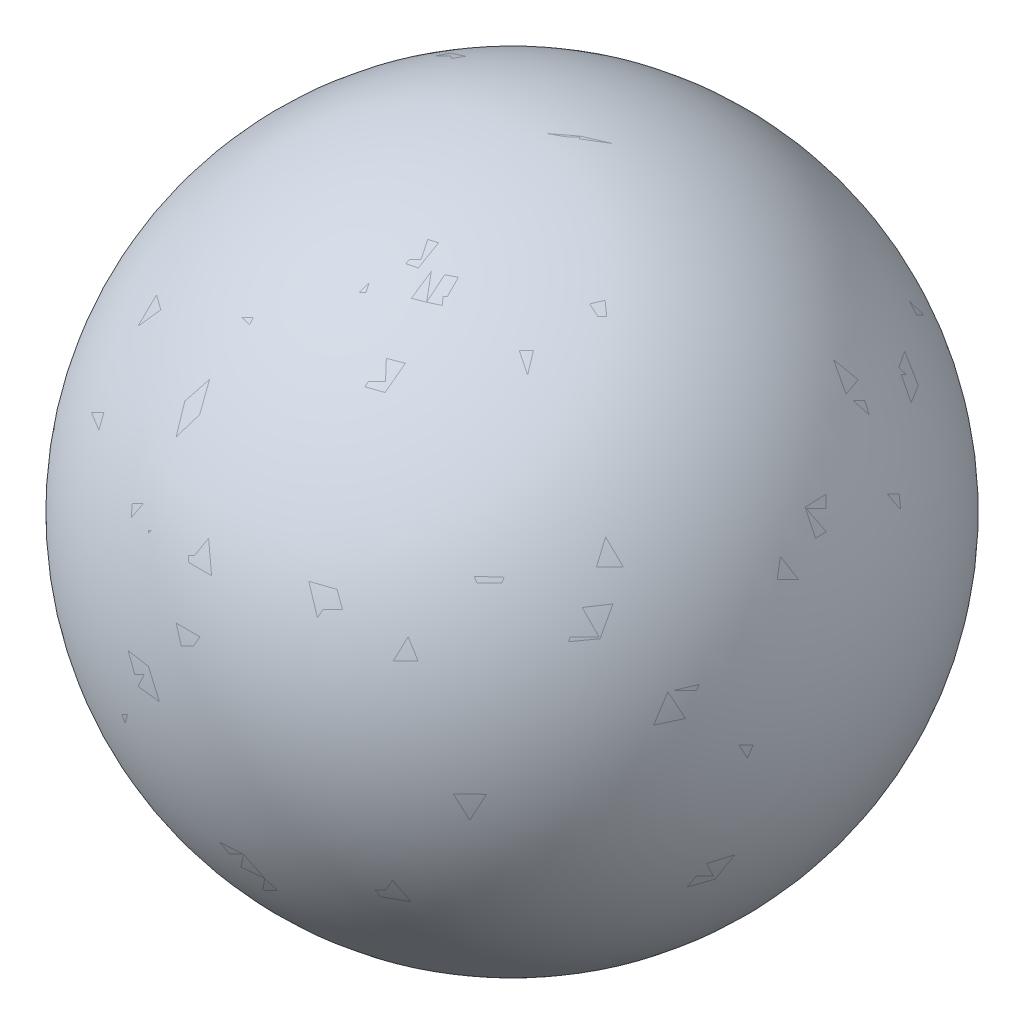
ISO-10303-21;
HEADER;
FILE_DESCRIPTION(('STEP AP214'),'2;1');
FILE_NAME('part.step','',(''),(''),'','','');
FILE_SCHEMA(('AUTOMOTIVE_DESIGN { 1 0 10303 214 1 1 1 1 }'));
ENDSEC;
DATA;
#1=APPLICATION_CONTEXT('core data for automotive mechanical design processes');
#2=APPLICATION_PROTOCOL_DEFINITION('international standard','automotive_design',2000,#1);
#3=PRODUCT_CONTEXT('',#1,'mechanical');
#4=PRODUCT('Part','Part','',(#3));
#5=PRODUCT_RELATED_PRODUCT_CATEGORY('part','',(#4));
#6=PRODUCT_DEFINITION_FORMATION('','',#4);
#7=PRODUCT_DEFINITION_CONTEXT('part definition',#1,'design');
#8=PRODUCT_DEFINITION('design','',#6,#7);
#9=PRODUCT_DEFINITION_SHAPE('','',#8);
#10=(LENGTH_UNIT() NAMED_UNIT(*) SI_UNIT(.MILLI.,.METRE.));
#11=(NAMED_UNIT(*) PLANE_ANGLE_UNIT() SI_UNIT($,.RADIAN.));
#12=(NAMED_UNIT(*) SI_UNIT($,.STERADIAN.) SOLID_ANGLE_UNIT());
#13=UNCERTAINTY_MEASURE_WITH_UNIT(LENGTH_MEASURE(1.E-05),#10,'distance_accuracy_value','');
#14=(GEOMETRIC_REPRESENTATION_CONTEXT(3) GLOBAL_UNCERTAINTY_ASSIGNED_CONTEXT((#13)) GLOBAL_UNIT_ASSIGNED_CONTEXT((#10,
#11,#12)) REPRESENTATION_CONTEXT('',''));
#15=CARTESIAN_POINT('',(0.,0.,0.));
#16=DIRECTION('',(0.,0.,1.));
#17=DIRECTION('',(1.,0.,0.));
#18=AXIS2_PLACEMENT_3D('',#15,#16,#17);
#19=CARTESIAN_POINT('',(0.,0.,0.));
#20=DIRECTION('',(0.,1.,0.));
#21=DIRECTION('',(1.,0.,0.));
#22=AXIS2_PLACEMENT_3D('',#19,#20,#21);
#23=SPHERICAL_SURFACE('',#22,100.);
#24=CARTESIAN_POINT('',(0.,100.,0.));
#25=VERTEX_POINT('',#24);
#26=VERTEX_LOOP('',#25);
#27=FACE_BOUND('',#26,.T.);
#28=ADVANCED_FACE('F42',(#27),#23,.T.);
#29=CLOSED_SHELL('',(#28));
#30=MANIFOLD_SOLID_BREP('B2',#29);
#31=CARTESIAN_POINT('',(0.,0.,0.));
#32=DIRECTION('',(0.,1.,0.));
#33=DIRECTION('',(1.,0.,0.));
#34=AXIS2_PLACEMENT_3D('',#31,#32,#33);
#35=SPHERICAL_SURFACE('',#34,100.);
#36=CARTESIAN_POINT('',(0.,100.,0.));
#37=VERTEX_POINT('',#36);
#38=VERTEX_LOOP('',#37);
#39=FACE_BOUND('',#38,.T.);
#40=ADVANCED_FACE('F56',(#39),#35,.T.);
#41=CLOSED_SHELL('',(#40));
#42=MANIFOLD_SOLID_BREP('B6',#41);
#43=ADVANCED_BREP_SHAPE_REPRESENTATION('',(#18,#30,#42),#14);
#44=SHAPE_DEFINITION_REPRESENTATION(#9,#43);
ENDSEC;
END-ISO-10303-21;
